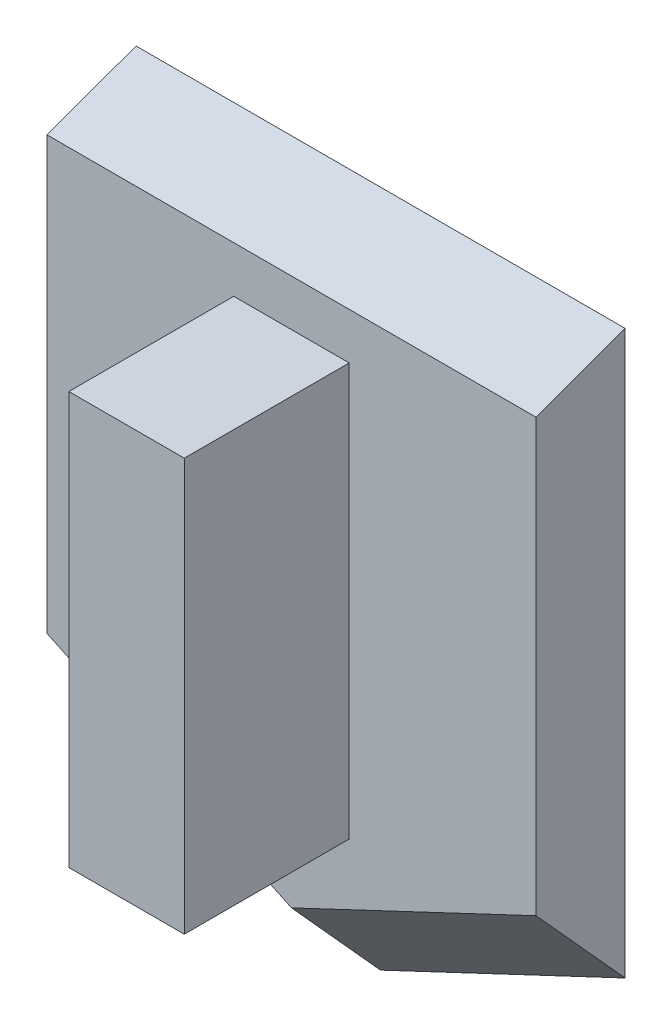
ISO-10303-21;
HEADER;
FILE_DESCRIPTION(('STEP AP214'),'2;1');
FILE_NAME('part.step','',(''),(''),'','','');
FILE_SCHEMA(('AUTOMOTIVE_DESIGN { 1 0 10303 214 1 1 1 1 }'));
ENDSEC;
DATA;
#1=APPLICATION_CONTEXT('core data for automotive mechanical design processes');
#2=APPLICATION_PROTOCOL_DEFINITION('international standard','automotive_design',2000,#1);
#3=PRODUCT_CONTEXT('',#1,'mechanical');
#4=PRODUCT('Part','Part','',(#3));
#5=PRODUCT_RELATED_PRODUCT_CATEGORY('part','',(#4));
#6=PRODUCT_DEFINITION_FORMATION('','',#4);
#7=PRODUCT_DEFINITION_CONTEXT('part definition',#1,'design');
#8=PRODUCT_DEFINITION('design','',#6,#7);
#9=PRODUCT_DEFINITION_SHAPE('','',#8);
#10=(LENGTH_UNIT() NAMED_UNIT(*) SI_UNIT(.MILLI.,.METRE.));
#11=(NAMED_UNIT(*) PLANE_ANGLE_UNIT() SI_UNIT($,.RADIAN.));
#12=(NAMED_UNIT(*) SI_UNIT($,.STERADIAN.) SOLID_ANGLE_UNIT());
#13=UNCERTAINTY_MEASURE_WITH_UNIT(LENGTH_MEASURE(1.E-05),#10,'distance_accuracy_value','');
#14=(GEOMETRIC_REPRESENTATION_CONTEXT(3) GLOBAL_UNCERTAINTY_ASSIGNED_CONTEXT((#13)) GLOBAL_UNIT_ASSIGNED_CONTEXT((#10,
#11,#12)) REPRESENTATION_CONTEXT('',''));
#15=CARTESIAN_POINT('',(0.,0.,0.));
#16=DIRECTION('',(0.,0.,1.));
#17=DIRECTION('',(1.,0.,0.));
#18=AXIS2_PLACEMENT_3D('',#15,#16,#17);
#19=CARTESIAN_POINT('',(0.,0.,5.4));
#20=DIRECTION('',(0.,0.,-1.));
#21=DIRECTION('',(-1.,0.,0.));
#22=AXIS2_PLACEMENT_3D('',#19,#20,#21);
#23=PLANE('',#22);
#24=DIRECTION('',(0.,1.,0.));
#25=VECTOR('',#24,1.);
#26=CARTESIAN_POINT('',(14.825,17.5,5.4));
#27=LINE('',#26,#25);
#28=CARTESIAN_POINT('',(14.825,-10.8647769290157,5.4));
#29=VERTEX_POINT('',#28);
#30=CARTESIAN_POINT('',(14.825,15.3161785944027,5.4));
#31=VERTEX_POINT('',#30);
#32=EDGE_CURVE('E137',#29,#31,#27,.T.);
#33=ORIENTED_EDGE('',*,*,#32,.T.);
#34=DIRECTION('',(-1.,0.,0.));
#35=VECTOR('',#34,1.);
#36=CARTESIAN_POINT('',(0.,15.3161785944027,5.4));
#37=LINE('',#36,#35);
#38=CARTESIAN_POINT('',(-14.825,15.3161785944027,5.4));
#39=VERTEX_POINT('',#38);
#40=EDGE_CURVE('E159',#31,#39,#37,.T.);
#41=ORIENTED_EDGE('',*,*,#40,.T.);
#42=DIRECTION('',(0.,-1.,0.));
#43=VECTOR('',#42,1.);
#44=CARTESIAN_POINT('',(-14.825,17.5,5.4));
#45=LINE('',#44,#43);
#46=CARTESIAN_POINT('',(-14.825,-10.8647769290157,5.4));
#47=VERTEX_POINT('',#46);
#48=EDGE_CURVE('E140',#39,#47,#45,.T.);
#49=ORIENTED_EDGE('',*,*,#48,.T.);
#50=DIRECTION('',(0.904265001464377,-0.426971670168677,0.));
#51=VECTOR('',#50,1.);
#52=CARTESIAN_POINT('',(-6.89751065877089,-14.6079422166112,5.4));
#53=LINE('',#52,#51);
#54=CARTESIAN_POINT('',(0.,-17.8647769290157,5.4));
#55=VERTEX_POINT('',#54);
#56=EDGE_CURVE('E143',#47,#55,#53,.T.);
#57=ORIENTED_EDGE('',*,*,#56,.T.);
#58=DIRECTION('',(0.904265001464377,0.426971670168677,0.));
#59=VECTOR('',#58,1.);
#60=CARTESIAN_POINT('',(6.89751065877089,-14.6079422166112,5.4));
#61=LINE('',#60,#59);
#62=EDGE_CURVE('E147',#55,#29,#61,.T.);
#63=ORIENTED_EDGE('',*,*,#62,.T.);
#64=EDGE_LOOP('',(#33,#41,#49,#57,#63));
#65=FACE_BOUND('',#64,.T.);
#66=DIRECTION('',(0.,1.,0.));
#67=VECTOR('',#66,1.);
#68=CARTESIAN_POINT('',(3.5,12.5,5.4));
#69=LINE('',#68,#67);
#70=CARTESIAN_POINT('',(3.5,-12.5,5.4));
#71=VERTEX_POINT('',#70);
#72=CARTESIAN_POINT('',(3.5,12.5,5.4));
#73=VERTEX_POINT('',#72);
#74=EDGE_CURVE('E127',#71,#73,#69,.T.);
#75=ORIENTED_EDGE('',*,*,#74,.F.);
#76=DIRECTION('',(1.,0.,0.));
#77=VECTOR('',#76,1.);
#78=CARTESIAN_POINT('',(-3.5,-12.5,5.4));
#79=LINE('',#78,#77);
#80=CARTESIAN_POINT('',(-3.5,-12.5,5.4));
#81=VERTEX_POINT('',#80);
#82=EDGE_CURVE('E124',#81,#71,#79,.T.);
#83=ORIENTED_EDGE('',*,*,#82,.F.);
#84=DIRECTION('',(0.,-1.,0.));
#85=VECTOR('',#84,1.);
#86=CARTESIAN_POINT('',(-3.5,12.5,5.4));
#87=LINE('',#86,#85);
#88=CARTESIAN_POINT('',(-3.5,12.5,5.4));
#89=VERTEX_POINT('',#88);
#90=EDGE_CURVE('E285',#89,#81,#87,.T.);
#91=ORIENTED_EDGE('',*,*,#90,.F.);
#92=DIRECTION('',(-1.,0.,0.));
#93=VECTOR('',#92,1.);
#94=CARTESIAN_POINT('',(-3.5,12.5,5.4));
#95=LINE('',#94,#93);
#96=EDGE_CURVE('E291',#73,#89,#95,.T.);
#97=ORIENTED_EDGE('',*,*,#96,.F.);
#98=EDGE_LOOP('',(#75,#83,#91,#97));
#99=FACE_BOUND('',#98,.T.);
#100=ADVANCED_FACE('F33',(#65,#99),#23,.F.);
#101=CARTESIAN_POINT('',(14.825,17.5,5.4));
#102=DIRECTION('',(-1.,0.,0.));
#103=DIRECTION('',(0.,-1.,0.));
#104=AXIS2_PLACEMENT_3D('',#101,#102,#103);
#105=PLANE('',#104);
#106=DIRECTION('',(0.,1.,0.));
#107=VECTOR('',#106,1.);
#108=CARTESIAN_POINT('',(14.825,17.5,0.));
#109=LINE('',#108,#107);
#110=CARTESIAN_POINT('',(14.825,-16.8364776929015,0.));
#111=VERTEX_POINT('',#110);
#112=CARTESIAN_POINT('',(14.825,17.2816178594403,0.));
#113=VERTEX_POINT('',#112);
#114=EDGE_CURVE('E131',#111,#113,#109,.T.);
#115=ORIENTED_EDGE('',*,*,#114,.T.);
#116=DIRECTION('',(0.,0.342020143325675,-0.939692620785906));
#117=VECTOR('',#116,1.);
#118=CARTESIAN_POINT('',(14.825,15.3161785944027,5.4));
#119=LINE('',#118,#117);
#120=EDGE_CURVE('E11',#113,#31,#119,.F.);
#121=ORIENTED_EDGE('',*,*,#120,.T.);
#122=ORIENTED_EDGE('',*,*,#32,.F.);
#123=DIRECTION('',(0.,0.741719113657357,0.67071063539752));
#124=VECTOR('',#123,1.);
#125=CARTESIAN_POINT('',(14.825,-12.9240689941933,3.53785425766663));
#126=LINE('',#125,#124);
#127=EDGE_CURVE('E150',#29,#111,#126,.F.);
#128=ORIENTED_EDGE('',*,*,#127,.T.);
#129=EDGE_LOOP('',(#115,#121,#122,#128));
#130=FACE_BOUND('',#129,.T.);
#131=ADVANCED_FACE('F179',(#130),#105,.F.);
#132=CARTESIAN_POINT('',(-14.825,17.5,5.4));
#133=DIRECTION('',(1.,0.,0.));
#134=DIRECTION('',(0.,1.,0.));
#135=AXIS2_PLACEMENT_3D('',#132,#133,#134);
#136=PLANE('',#135);
#137=ORIENTED_EDGE('',*,*,#48,.F.);
#138=DIRECTION('',(0.,-0.342020143325675,0.939692620785906));
#139=VECTOR('',#138,1.);
#140=CARTESIAN_POINT('',(-14.825,15.3161785944027,5.4));
#141=LINE('',#140,#139);
#142=CARTESIAN_POINT('',(-14.825,17.2816178594403,0.));
#143=VERTEX_POINT('',#142);
#144=EDGE_CURVE('E55',#39,#143,#141,.F.);
#145=ORIENTED_EDGE('',*,*,#144,.T.);
#146=DIRECTION('',(0.,-1.,0.));
#147=VECTOR('',#146,1.);
#148=CARTESIAN_POINT('',(-14.825,17.5,0.));
#149=LINE('',#148,#147);
#150=CARTESIAN_POINT('',(-14.825,-16.8364776929015,0.));
#151=VERTEX_POINT('',#150);
#152=EDGE_CURVE('E141',#143,#151,#149,.T.);
#153=ORIENTED_EDGE('',*,*,#152,.T.);
#154=DIRECTION('',(0.,-0.741719113657357,-0.67071063539752));
#155=VECTOR('',#154,1.);
#156=CARTESIAN_POINT('',(-14.825,-12.9240689941933,3.53785425766663));
#157=LINE('',#156,#155);
#158=EDGE_CURVE('E157',#151,#47,#157,.F.);
#159=ORIENTED_EDGE('',*,*,#158,.T.);
#160=EDGE_LOOP('',(#137,#145,#153,#159));
#161=FACE_BOUND('',#160,.T.);
#162=ADVANCED_FACE('F169',(#161),#136,.F.);
#163=CARTESIAN_POINT('',(0.,0.,0.));
#164=DIRECTION('',(0.,0.,-1.));
#165=DIRECTION('',(-1.,0.,0.));
#166=AXIS2_PLACEMENT_3D('',#163,#164,#165);
#167=PLANE('',#166);
#168=ORIENTED_EDGE('',*,*,#152,.F.);
#169=DIRECTION('',(-1.,0.,0.));
#170=VECTOR('',#169,1.);
#171=CARTESIAN_POINT('',(0.,17.2816178594403,0.));
#172=LINE('',#171,#170);
#173=EDGE_CURVE('E41',#143,#113,#172,.F.);
#174=ORIENTED_EDGE('',*,*,#173,.T.);
#175=ORIENTED_EDGE('',*,*,#114,.F.);
#176=DIRECTION('',(0.904265001464377,0.426971670168677,0.));
#177=VECTOR('',#176,1.);
#178=CARTESIAN_POINT('',(9.20315767768177,-19.4909732245189,0.));
#179=LINE('',#178,#177);
#180=CARTESIAN_POINT('',(0.,-23.8364776929015,0.));
#181=VERTEX_POINT('',#180);
#182=EDGE_CURVE('E155',#111,#181,#179,.F.);
#183=ORIENTED_EDGE('',*,*,#182,.T.);
#184=DIRECTION('',(0.904265001464377,-0.426971670168677,0.));
#185=VECTOR('',#184,1.);
#186=CARTESIAN_POINT('',(-9.20315767768177,-19.4909732245189,0.));
#187=LINE('',#186,#185);
#188=EDGE_CURVE('E152',#181,#151,#187,.F.);
#189=ORIENTED_EDGE('',*,*,#188,.T.);
#190=EDGE_LOOP('',(#168,#174,#175,#183,#189));
#191=FACE_BOUND('',#190,.T.);
#192=ADVANCED_FACE('F195',(#191),#167,.T.);
#193=CARTESIAN_POINT('',(-6.89751065877089,-14.6079422166112,5.4));
#194=DIRECTION('',(0.301914563350816,0.639411914525121,-0.707106781186551));
#195=DIRECTION('',(0.904265001464377,-0.426971670168677,0.));
#196=AXIS2_PLACEMENT_3D('',#193,#194,#195);
#197=PLANE('',#196);
#198=ORIENTED_EDGE('',*,*,#158,.F.);
#199=ORIENTED_EDGE('',*,*,#188,.F.);
#200=DIRECTION('',(0.,0.741719113657357,0.67071063539752));
#201=VECTOR('',#200,1.);
#202=CARTESIAN_POINT('',(0.,-16.0730382892407,7.02020654371991));
#203=LINE('',#202,#201);
#204=EDGE_CURVE('E128',#55,#181,#203,.F.);
#205=ORIENTED_EDGE('',*,*,#204,.F.);
#206=ORIENTED_EDGE('',*,*,#56,.F.);
#207=EDGE_LOOP('',(#198,#199,#205,#206));
#208=FACE_BOUND('',#207,.T.);
#209=ADVANCED_FACE('F175',(#208),#197,.F.);
#210=CARTESIAN_POINT('',(6.89751065877089,-14.6079422166112,5.4));
#211=DIRECTION('',(-0.301914563350816,0.639411914525121,-0.707106781186551));
#212=DIRECTION('',(0.904265001464377,0.426971670168677,0.));
#213=AXIS2_PLACEMENT_3D('',#210,#211,#212);
#214=PLANE('',#213);
#215=ORIENTED_EDGE('',*,*,#204,.T.);
#216=ORIENTED_EDGE('',*,*,#182,.F.);
#217=ORIENTED_EDGE('',*,*,#127,.F.);
#218=ORIENTED_EDGE('',*,*,#62,.F.);
#219=EDGE_LOOP('',(#215,#216,#217,#218));
#220=FACE_BOUND('',#219,.T.);
#221=ADVANCED_FACE('F200',(#220),#214,.F.);
#222=CARTESIAN_POINT('',(3.5,12.5,15.4));
#223=DIRECTION('',(-1.,0.,0.));
#224=DIRECTION('',(0.,-1.,0.));
#225=AXIS2_PLACEMENT_3D('',#222,#223,#224);
#226=PLANE('',#225);
#227=ORIENTED_EDGE('',*,*,#74,.T.);
#228=DIRECTION('',(0.,0.,-1.));
#229=VECTOR('',#228,1.);
#230=CARTESIAN_POINT('',(3.5,12.5,15.4));
#231=LINE('',#230,#229);
#232=CARTESIAN_POINT('',(3.5,12.5,15.4));
#233=VERTEX_POINT('',#232);
#234=EDGE_CURVE('E108',#233,#73,#231,.T.);
#235=ORIENTED_EDGE('',*,*,#234,.F.);
#236=DIRECTION('',(0.,1.,0.));
#237=VECTOR('',#236,1.);
#238=CARTESIAN_POINT('',(3.5,12.5,15.4));
#239=LINE('',#238,#237);
#240=CARTESIAN_POINT('',(3.5,-12.5,15.4));
#241=VERTEX_POINT('',#240);
#242=EDGE_CURVE('E115',#241,#233,#239,.T.);
#243=ORIENTED_EDGE('',*,*,#242,.F.);
#244=DIRECTION('',(0.,0.,-1.));
#245=VECTOR('',#244,1.);
#246=CARTESIAN_POINT('',(3.5,-12.5,15.4));
#247=LINE('',#246,#245);
#248=EDGE_CURVE('E282',#241,#71,#247,.T.);
#249=ORIENTED_EDGE('',*,*,#248,.T.);
#250=EDGE_LOOP('',(#227,#235,#243,#249));
#251=FACE_BOUND('',#250,.T.);
#252=ADVANCED_FACE('F126',(#251),#226,.F.);
#253=CARTESIAN_POINT('',(-3.5,12.5,15.4));
#254=DIRECTION('',(0.,-1.,0.));
#255=DIRECTION('',(0.,0.,-1.));
#256=AXIS2_PLACEMENT_3D('',#253,#254,#255);
#257=PLANE('',#256);
#258=ORIENTED_EDGE('',*,*,#96,.T.);
#259=DIRECTION('',(0.,0.,-1.));
#260=VECTOR('',#259,1.);
#261=CARTESIAN_POINT('',(-3.5,12.5,15.4));
#262=LINE('',#261,#260);
#263=CARTESIAN_POINT('',(-3.5,12.5,15.4));
#264=VERTEX_POINT('',#263);
#265=EDGE_CURVE('E111',#264,#89,#262,.T.);
#266=ORIENTED_EDGE('',*,*,#265,.F.);
#267=DIRECTION('',(-1.,0.,0.));
#268=VECTOR('',#267,1.);
#269=CARTESIAN_POINT('',(-3.5,12.5,15.4));
#270=LINE('',#269,#268);
#271=EDGE_CURVE('E103',#233,#264,#270,.T.);
#272=ORIENTED_EDGE('',*,*,#271,.F.);
#273=ORIENTED_EDGE('',*,*,#234,.T.);
#274=EDGE_LOOP('',(#258,#266,#272,#273));
#275=FACE_BOUND('',#274,.T.);
#276=ADVANCED_FACE('F106',(#275),#257,.F.);
#277=CARTESIAN_POINT('',(-3.5,12.5,15.4));
#278=DIRECTION('',(1.,0.,0.));
#279=DIRECTION('',(0.,1.,0.));
#280=AXIS2_PLACEMENT_3D('',#277,#278,#279);
#281=PLANE('',#280);
#282=ORIENTED_EDGE('',*,*,#90,.T.);
#283=DIRECTION('',(0.,0.,-1.));
#284=VECTOR('',#283,1.);
#285=CARTESIAN_POINT('',(-3.5,-12.5,15.4));
#286=LINE('',#285,#284);
#287=CARTESIAN_POINT('',(-3.5,-12.5,15.4));
#288=VERTEX_POINT('',#287);
#289=EDGE_CURVE('E133',#288,#81,#286,.T.);
#290=ORIENTED_EDGE('',*,*,#289,.F.);
#291=DIRECTION('',(0.,-1.,0.));
#292=VECTOR('',#291,1.);
#293=CARTESIAN_POINT('',(-3.5,12.5,15.4));
#294=LINE('',#293,#292);
#295=EDGE_CURVE('E114',#264,#288,#294,.T.);
#296=ORIENTED_EDGE('',*,*,#295,.F.);
#297=ORIENTED_EDGE('',*,*,#265,.T.);
#298=EDGE_LOOP('',(#282,#290,#296,#297));
#299=FACE_BOUND('',#298,.T.);
#300=ADVANCED_FACE('F222',(#299),#281,.F.);
#301=CARTESIAN_POINT('',(-3.5,-12.5,15.4));
#302=DIRECTION('',(0.,1.,0.));
#303=DIRECTION('',(0.,0.,1.));
#304=AXIS2_PLACEMENT_3D('',#301,#302,#303);
#305=PLANE('',#304);
#306=ORIENTED_EDGE('',*,*,#82,.T.);
#307=ORIENTED_EDGE('',*,*,#248,.F.);
#308=DIRECTION('',(1.,0.,0.));
#309=VECTOR('',#308,1.);
#310=CARTESIAN_POINT('',(-3.5,-12.5,15.4));
#311=LINE('',#310,#309);
#312=EDGE_CURVE('E120',#288,#241,#311,.T.);
#313=ORIENTED_EDGE('',*,*,#312,.F.);
#314=ORIENTED_EDGE('',*,*,#289,.T.);
#315=EDGE_LOOP('',(#306,#307,#313,#314));
#316=FACE_BOUND('',#315,.T.);
#317=ADVANCED_FACE('F184',(#316),#305,.F.);
#318=CARTESIAN_POINT('',(0.,0.,15.4));
#319=DIRECTION('',(0.,0.,1.));
#320=DIRECTION('',(1.,0.,0.));
#321=AXIS2_PLACEMENT_3D('',#318,#319,#320);
#322=PLANE('',#321);
#323=ORIENTED_EDGE('',*,*,#242,.T.);
#324=ORIENTED_EDGE('',*,*,#271,.T.);
#325=ORIENTED_EDGE('',*,*,#295,.T.);
#326=ORIENTED_EDGE('',*,*,#312,.T.);
#327=EDGE_LOOP('',(#323,#324,#325,#326));
#328=FACE_BOUND('',#327,.T.);
#329=ADVANCED_FACE('F118',(#328),#322,.T.);
#330=CARTESIAN_POINT('',(0.,15.3161785944027,5.4));
#331=DIRECTION('',(0.,-0.939692620785906,-0.342020143325675));
#332=DIRECTION('',(-1.,0.,0.));
#333=AXIS2_PLACEMENT_3D('',#330,#331,#332);
#334=PLANE('',#333);
#335=ORIENTED_EDGE('',*,*,#120,.F.);
#336=ORIENTED_EDGE('',*,*,#173,.F.);
#337=ORIENTED_EDGE('',*,*,#144,.F.);
#338=ORIENTED_EDGE('',*,*,#40,.F.);
#339=EDGE_LOOP('',(#335,#336,#337,#338));
#340=FACE_BOUND('',#339,.T.);
#341=ADVANCED_FACE('F35',(#340),#334,.F.);
#342=CLOSED_SHELL('',(#100,#131,#162,#192,#209,#221,#252,#276,#300,#317,#329,#341));
#343=MANIFOLD_SOLID_BREP('B2',#342);
#344=ADVANCED_BREP_SHAPE_REPRESENTATION('',(#18,#343),#14);
#345=SHAPE_DEFINITION_REPRESENTATION(#9,#344);
ENDSEC;
END-ISO-10303-21;
